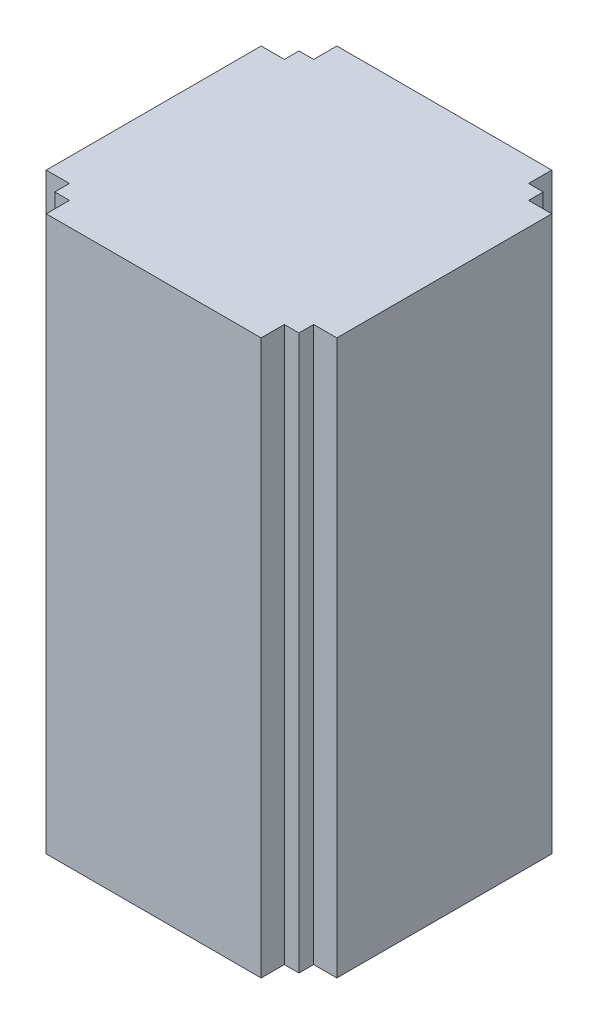
ISO-10303-21;
HEADER;
FILE_DESCRIPTION(('STEP AP214'),'2;1');
FILE_NAME('part.step','',(''),(''),'','','');
FILE_SCHEMA(('AUTOMOTIVE_DESIGN { 1 0 10303 214 1 1 1 1 }'));
ENDSEC;
DATA;
#1=APPLICATION_CONTEXT('core data for automotive mechanical design processes');
#2=APPLICATION_PROTOCOL_DEFINITION('international standard','automotive_design',2000,#1);
#3=PRODUCT_CONTEXT('',#1,'mechanical');
#4=PRODUCT('Part','Part','',(#3));
#5=PRODUCT_RELATED_PRODUCT_CATEGORY('part','',(#4));
#6=PRODUCT_DEFINITION_FORMATION('','',#4);
#7=PRODUCT_DEFINITION_CONTEXT('part definition',#1,'design');
#8=PRODUCT_DEFINITION('design','',#6,#7);
#9=PRODUCT_DEFINITION_SHAPE('','',#8);
#10=(LENGTH_UNIT() NAMED_UNIT(*) SI_UNIT(.MILLI.,.METRE.));
#11=(NAMED_UNIT(*) PLANE_ANGLE_UNIT() SI_UNIT($,.RADIAN.));
#12=(NAMED_UNIT(*) SI_UNIT($,.STERADIAN.) SOLID_ANGLE_UNIT());
#13=UNCERTAINTY_MEASURE_WITH_UNIT(LENGTH_MEASURE(1.E-05),#10,'distance_accuracy_value','');
#14=(GEOMETRIC_REPRESENTATION_CONTEXT(3) GLOBAL_UNCERTAINTY_ASSIGNED_CONTEXT((#13)) GLOBAL_UNIT_ASSIGNED_CONTEXT((#10,
#11,#12)) REPRESENTATION_CONTEXT('',''));
#15=CARTESIAN_POINT('',(0.,0.,0.));
#16=DIRECTION('',(0.,0.,1.));
#17=DIRECTION('',(1.,0.,0.));
#18=AXIS2_PLACEMENT_3D('',#15,#16,#17);
#19=CARTESIAN_POINT('',(50.,227.,-44.));
#20=DIRECTION('',(-1.,0.,0.));
#21=DIRECTION('',(0.,0.,1.));
#22=AXIS2_PLACEMENT_3D('',#19,#20,#21);
#23=PLANE('',#22);
#24=DIRECTION('',(0.,0.,-1.));
#25=VECTOR('',#24,1.);
#26=CARTESIAN_POINT('',(50.,0.,-44.));
#27=LINE('',#26,#25);
#28=CARTESIAN_POINT('',(50.,0.,-44.));
#29=VERTEX_POINT('',#28);
#30=CARTESIAN_POINT('',(50.,0.,-50.));
#31=VERTEX_POINT('',#30);
#32=EDGE_CURVE('E200',#29,#31,#27,.T.);
#33=ORIENTED_EDGE('',*,*,#32,.T.);
#34=DIRECTION('',(0.,-1.,0.));
#35=VECTOR('',#34,1.);
#36=CARTESIAN_POINT('',(50.,227.,-50.));
#37=LINE('',#36,#35);
#38=CARTESIAN_POINT('',(50.,227.,-50.));
#39=VERTEX_POINT('',#38);
#40=EDGE_CURVE('E11',#39,#31,#37,.T.);
#41=ORIENTED_EDGE('',*,*,#40,.F.);
#42=DIRECTION('',(0.,0.,-1.));
#43=VECTOR('',#42,1.);
#44=CARTESIAN_POINT('',(50.,227.,-44.));
#45=LINE('',#44,#43);
#46=CARTESIAN_POINT('',(50.,227.,-44.));
#47=VERTEX_POINT('',#46);
#48=EDGE_CURVE('E238',#47,#39,#45,.T.);
#49=ORIENTED_EDGE('',*,*,#48,.F.);
#50=DIRECTION('',(0.,-1.,0.));
#51=VECTOR('',#50,1.);
#52=CARTESIAN_POINT('',(50.,227.,-44.));
#53=LINE('',#52,#51);
#54=EDGE_CURVE('E196',#47,#29,#53,.T.);
#55=ORIENTED_EDGE('',*,*,#54,.T.);
#56=EDGE_LOOP('',(#33,#41,#49,#55));
#57=FACE_BOUND('',#56,.T.);
#58=ADVANCED_FACE('F32',(#57),#23,.F.);
#59=CARTESIAN_POINT('',(44.,227.,-50.));
#60=DIRECTION('',(0.,0.,1.));
#61=DIRECTION('',(1.,0.,0.));
#62=AXIS2_PLACEMENT_3D('',#59,#60,#61);
#63=PLANE('',#62);
#64=DIRECTION('',(-1.,0.,0.));
#65=VECTOR('',#64,1.);
#66=CARTESIAN_POINT('',(44.,0.,-50.));
#67=LINE('',#66,#65);
#68=CARTESIAN_POINT('',(44.,0.,-50.));
#69=VERTEX_POINT('',#68);
#70=EDGE_CURVE('E203',#31,#69,#67,.T.);
#71=ORIENTED_EDGE('',*,*,#70,.T.);
#72=DIRECTION('',(0.,-1.,0.));
#73=VECTOR('',#72,1.);
#74=CARTESIAN_POINT('',(44.,227.,-50.));
#75=LINE('',#74,#73);
#76=CARTESIAN_POINT('',(44.,227.,-50.));
#77=VERTEX_POINT('',#76);
#78=EDGE_CURVE('E40',#77,#69,#75,.T.);
#79=ORIENTED_EDGE('',*,*,#78,.F.);
#80=DIRECTION('',(-1.,0.,0.));
#81=VECTOR('',#80,1.);
#82=CARTESIAN_POINT('',(44.,227.,-50.));
#83=LINE('',#82,#81);
#84=EDGE_CURVE('E127',#39,#77,#83,.T.);
#85=ORIENTED_EDGE('',*,*,#84,.F.);
#86=ORIENTED_EDGE('',*,*,#40,.T.);
#87=EDGE_LOOP('',(#71,#79,#85,#86));
#88=FACE_BOUND('',#87,.T.);
#89=ADVANCED_FACE('F356',(#88),#63,.F.);
#90=CARTESIAN_POINT('',(44.,227.,-50.));
#91=DIRECTION('',(-1.,0.,0.));
#92=DIRECTION('',(0.,0.,1.));
#93=AXIS2_PLACEMENT_3D('',#90,#91,#92);
#94=PLANE('',#93);
#95=DIRECTION('',(0.,0.,-1.));
#96=VECTOR('',#95,1.);
#97=CARTESIAN_POINT('',(44.,0.,-50.));
#98=LINE('',#97,#96);
#99=CARTESIAN_POINT('',(44.,0.,-59.5));
#100=VERTEX_POINT('',#99);
#101=EDGE_CURVE('E205',#69,#100,#98,.T.);
#102=ORIENTED_EDGE('',*,*,#101,.T.);
#103=DIRECTION('',(0.,-1.,0.));
#104=VECTOR('',#103,1.);
#105=CARTESIAN_POINT('',(44.,227.,-59.5));
#106=LINE('',#105,#104);
#107=CARTESIAN_POINT('',(44.,227.,-59.5));
#108=VERTEX_POINT('',#107);
#109=EDGE_CURVE('E281',#108,#100,#106,.T.);
#110=ORIENTED_EDGE('',*,*,#109,.F.);
#111=DIRECTION('',(0.,0.,-1.));
#112=VECTOR('',#111,1.);
#113=CARTESIAN_POINT('',(44.,227.,-50.));
#114=LINE('',#113,#112);
#115=EDGE_CURVE('E289',#77,#108,#114,.T.);
#116=ORIENTED_EDGE('',*,*,#115,.F.);
#117=ORIENTED_EDGE('',*,*,#78,.T.);
#118=EDGE_LOOP('',(#102,#110,#116,#117));
#119=FACE_BOUND('',#118,.T.);
#120=ADVANCED_FACE('F287',(#119),#94,.F.);
#121=CARTESIAN_POINT('',(-44.,227.,-59.5));
#122=DIRECTION('',(0.,0.,1.));
#123=DIRECTION('',(1.,0.,0.));
#124=AXIS2_PLACEMENT_3D('',#121,#122,#123);
#125=PLANE('',#124);
#126=DIRECTION('',(-1.,0.,0.));
#127=VECTOR('',#126,1.);
#128=CARTESIAN_POINT('',(-44.,0.,-59.5));
#129=LINE('',#128,#127);
#130=CARTESIAN_POINT('',(-44.,0.,-59.5));
#131=VERTEX_POINT('',#130);
#132=EDGE_CURVE('E207',#100,#131,#129,.T.);
#133=ORIENTED_EDGE('',*,*,#132,.T.);
#134=DIRECTION('',(0.,-1.,0.));
#135=VECTOR('',#134,1.);
#136=CARTESIAN_POINT('',(-44.,227.,-59.5));
#137=LINE('',#136,#135);
#138=CARTESIAN_POINT('',(-44.,227.,-59.5));
#139=VERTEX_POINT('',#138);
#140=EDGE_CURVE('E278',#139,#131,#137,.T.);
#141=ORIENTED_EDGE('',*,*,#140,.F.);
#142=DIRECTION('',(-1.,0.,0.));
#143=VECTOR('',#142,1.);
#144=CARTESIAN_POINT('',(-44.,227.,-59.5));
#145=LINE('',#144,#143);
#146=EDGE_CURVE('E307',#108,#139,#145,.T.);
#147=ORIENTED_EDGE('',*,*,#146,.F.);
#148=ORIENTED_EDGE('',*,*,#109,.T.);
#149=EDGE_LOOP('',(#133,#141,#147,#148));
#150=FACE_BOUND('',#149,.T.);
#151=ADVANCED_FACE('F298',(#150),#125,.F.);
#152=CARTESIAN_POINT('',(-44.,227.,-50.));
#153=DIRECTION('',(1.,0.,0.));
#154=DIRECTION('',(0.,0.,-1.));
#155=AXIS2_PLACEMENT_3D('',#152,#153,#154);
#156=PLANE('',#155);
#157=DIRECTION('',(0.,0.,1.));
#158=VECTOR('',#157,1.);
#159=CARTESIAN_POINT('',(-44.,0.,-50.));
#160=LINE('',#159,#158);
#161=CARTESIAN_POINT('',(-44.,0.,-50.));
#162=VERTEX_POINT('',#161);
#163=EDGE_CURVE('E209',#131,#162,#160,.T.);
#164=ORIENTED_EDGE('',*,*,#163,.T.);
#165=DIRECTION('',(0.,-1.,0.));
#166=VECTOR('',#165,1.);
#167=CARTESIAN_POINT('',(-44.,227.,-50.));
#168=LINE('',#167,#166);
#169=CARTESIAN_POINT('',(-44.,227.,-50.));
#170=VERTEX_POINT('',#169);
#171=EDGE_CURVE('E275',#170,#162,#168,.T.);
#172=ORIENTED_EDGE('',*,*,#171,.F.);
#173=DIRECTION('',(0.,0.,1.));
#174=VECTOR('',#173,1.);
#175=CARTESIAN_POINT('',(-44.,227.,-50.));
#176=LINE('',#175,#174);
#177=EDGE_CURVE('E304',#139,#170,#176,.T.);
#178=ORIENTED_EDGE('',*,*,#177,.F.);
#179=ORIENTED_EDGE('',*,*,#140,.T.);
#180=EDGE_LOOP('',(#164,#172,#178,#179));
#181=FACE_BOUND('',#180,.T.);
#182=ADVANCED_FACE('F302',(#181),#156,.F.);
#183=CARTESIAN_POINT('',(-50.,227.,-50.));
#184=DIRECTION('',(0.,0.,1.));
#185=DIRECTION('',(1.,0.,0.));
#186=AXIS2_PLACEMENT_3D('',#183,#184,#185);
#187=PLANE('',#186);
#188=DIRECTION('',(-1.,0.,0.));
#189=VECTOR('',#188,1.);
#190=CARTESIAN_POINT('',(-50.,0.,-50.));
#191=LINE('',#190,#189);
#192=CARTESIAN_POINT('',(-50.,0.,-50.));
#193=VERTEX_POINT('',#192);
#194=EDGE_CURVE('E211',#162,#193,#191,.T.);
#195=ORIENTED_EDGE('',*,*,#194,.T.);
#196=DIRECTION('',(0.,-1.,0.));
#197=VECTOR('',#196,1.);
#198=CARTESIAN_POINT('',(-50.,227.,-50.));
#199=LINE('',#198,#197);
#200=CARTESIAN_POINT('',(-50.,227.,-50.));
#201=VERTEX_POINT('',#200);
#202=EDGE_CURVE('E272',#201,#193,#199,.T.);
#203=ORIENTED_EDGE('',*,*,#202,.F.);
#204=DIRECTION('',(-1.,0.,0.));
#205=VECTOR('',#204,1.);
#206=CARTESIAN_POINT('',(-50.,227.,-50.));
#207=LINE('',#206,#205);
#208=EDGE_CURVE('E306',#170,#201,#207,.T.);
#209=ORIENTED_EDGE('',*,*,#208,.F.);
#210=ORIENTED_EDGE('',*,*,#171,.T.);
#211=EDGE_LOOP('',(#195,#203,#209,#210));
#212=FACE_BOUND('',#211,.T.);
#213=ADVANCED_FACE('F369',(#212),#187,.F.);
#214=CARTESIAN_POINT('',(-50.,227.,-44.));
#215=DIRECTION('',(1.,0.,0.));
#216=DIRECTION('',(0.,0.,-1.));
#217=AXIS2_PLACEMENT_3D('',#214,#215,#216);
#218=PLANE('',#217);
#219=DIRECTION('',(0.,0.,1.));
#220=VECTOR('',#219,1.);
#221=CARTESIAN_POINT('',(-50.,0.,-44.));
#222=LINE('',#221,#220);
#223=CARTESIAN_POINT('',(-50.,0.,-44.));
#224=VERTEX_POINT('',#223);
#225=EDGE_CURVE('E213',#193,#224,#222,.T.);
#226=ORIENTED_EDGE('',*,*,#225,.T.);
#227=DIRECTION('',(0.,-1.,0.));
#228=VECTOR('',#227,1.);
#229=CARTESIAN_POINT('',(-50.,227.,-44.));
#230=LINE('',#229,#228);
#231=CARTESIAN_POINT('',(-50.,227.,-44.));
#232=VERTEX_POINT('',#231);
#233=EDGE_CURVE('E269',#232,#224,#230,.T.);
#234=ORIENTED_EDGE('',*,*,#233,.F.);
#235=DIRECTION('',(0.,0.,1.));
#236=VECTOR('',#235,1.);
#237=CARTESIAN_POINT('',(-50.,227.,-44.));
#238=LINE('',#237,#236);
#239=EDGE_CURVE('E309',#201,#232,#238,.T.);
#240=ORIENTED_EDGE('',*,*,#239,.F.);
#241=ORIENTED_EDGE('',*,*,#202,.T.);
#242=EDGE_LOOP('',(#226,#234,#240,#241));
#243=FACE_BOUND('',#242,.T.);
#244=ADVANCED_FACE('F372',(#243),#218,.F.);
#245=CARTESIAN_POINT('',(-59.5,227.,-44.));
#246=DIRECTION('',(0.,0.,1.));
#247=DIRECTION('',(1.,0.,0.));
#248=AXIS2_PLACEMENT_3D('',#245,#246,#247);
#249=PLANE('',#248);
#250=DIRECTION('',(-1.,0.,0.));
#251=VECTOR('',#250,1.);
#252=CARTESIAN_POINT('',(-59.5,0.,-44.));
#253=LINE('',#252,#251);
#254=CARTESIAN_POINT('',(-59.5,0.,-44.));
#255=VERTEX_POINT('',#254);
#256=EDGE_CURVE('E215',#224,#255,#253,.T.);
#257=ORIENTED_EDGE('',*,*,#256,.T.);
#258=DIRECTION('',(0.,-1.,0.));
#259=VECTOR('',#258,1.);
#260=CARTESIAN_POINT('',(-59.5,227.,-44.));
#261=LINE('',#260,#259);
#262=CARTESIAN_POINT('',(-59.5,227.,-44.));
#263=VERTEX_POINT('',#262);
#264=EDGE_CURVE('E266',#263,#255,#261,.T.);
#265=ORIENTED_EDGE('',*,*,#264,.F.);
#266=DIRECTION('',(-1.,0.,0.));
#267=VECTOR('',#266,1.);
#268=CARTESIAN_POINT('',(-59.5,227.,-44.));
#269=LINE('',#268,#267);
#270=EDGE_CURVE('E315',#232,#263,#269,.T.);
#271=ORIENTED_EDGE('',*,*,#270,.F.);
#272=ORIENTED_EDGE('',*,*,#233,.T.);
#273=EDGE_LOOP('',(#257,#265,#271,#272));
#274=FACE_BOUND('',#273,.T.);
#275=ADVANCED_FACE('F376',(#274),#249,.F.);
#276=CARTESIAN_POINT('',(-59.5,227.,44.));
#277=DIRECTION('',(1.,0.,0.));
#278=DIRECTION('',(0.,0.,-1.));
#279=AXIS2_PLACEMENT_3D('',#276,#277,#278);
#280=PLANE('',#279);
#281=DIRECTION('',(0.,0.,1.));
#282=VECTOR('',#281,1.);
#283=CARTESIAN_POINT('',(-59.5,0.,44.));
#284=LINE('',#283,#282);
#285=CARTESIAN_POINT('',(-59.5,0.,44.));
#286=VERTEX_POINT('',#285);
#287=EDGE_CURVE('E217',#255,#286,#284,.T.);
#288=ORIENTED_EDGE('',*,*,#287,.T.);
#289=DIRECTION('',(0.,-1.,0.));
#290=VECTOR('',#289,1.);
#291=CARTESIAN_POINT('',(-59.5,227.,44.));
#292=LINE('',#291,#290);
#293=CARTESIAN_POINT('',(-59.5,227.,44.));
#294=VERTEX_POINT('',#293);
#295=EDGE_CURVE('E263',#294,#286,#292,.T.);
#296=ORIENTED_EDGE('',*,*,#295,.F.);
#297=DIRECTION('',(0.,0.,1.));
#298=VECTOR('',#297,1.);
#299=CARTESIAN_POINT('',(-59.5,227.,44.));
#300=LINE('',#299,#298);
#301=EDGE_CURVE('E317',#263,#294,#300,.T.);
#302=ORIENTED_EDGE('',*,*,#301,.F.);
#303=ORIENTED_EDGE('',*,*,#264,.T.);
#304=EDGE_LOOP('',(#288,#296,#302,#303));
#305=FACE_BOUND('',#304,.T.);
#306=ADVANCED_FACE('F380',(#305),#280,.F.);
#307=CARTESIAN_POINT('',(-59.5,227.,44.));
#308=DIRECTION('',(0.,0.,-1.));
#309=DIRECTION('',(-1.,0.,0.));
#310=AXIS2_PLACEMENT_3D('',#307,#308,#309);
#311=PLANE('',#310);
#312=DIRECTION('',(1.,0.,0.));
#313=VECTOR('',#312,1.);
#314=CARTESIAN_POINT('',(-59.5,0.,44.));
#315=LINE('',#314,#313);
#316=CARTESIAN_POINT('',(-50.,0.,44.));
#317=VERTEX_POINT('',#316);
#318=EDGE_CURVE('E219',#286,#317,#315,.T.);
#319=ORIENTED_EDGE('',*,*,#318,.T.);
#320=DIRECTION('',(0.,-1.,0.));
#321=VECTOR('',#320,1.);
#322=CARTESIAN_POINT('',(-50.,227.,44.));
#323=LINE('',#322,#321);
#324=CARTESIAN_POINT('',(-50.,227.,44.));
#325=VERTEX_POINT('',#324);
#326=EDGE_CURVE('E260',#325,#317,#323,.T.);
#327=ORIENTED_EDGE('',*,*,#326,.F.);
#328=DIRECTION('',(1.,0.,0.));
#329=VECTOR('',#328,1.);
#330=CARTESIAN_POINT('',(-59.5,227.,44.));
#331=LINE('',#330,#329);
#332=EDGE_CURVE('E319',#294,#325,#331,.T.);
#333=ORIENTED_EDGE('',*,*,#332,.F.);
#334=ORIENTED_EDGE('',*,*,#295,.T.);
#335=EDGE_LOOP('',(#319,#327,#333,#334));
#336=FACE_BOUND('',#335,.T.);
#337=ADVANCED_FACE('F384',(#336),#311,.F.);
#338=CARTESIAN_POINT('',(-50.,227.,50.));
#339=DIRECTION('',(1.,0.,0.));
#340=DIRECTION('',(0.,0.,-1.));
#341=AXIS2_PLACEMENT_3D('',#338,#339,#340);
#342=PLANE('',#341);
#343=DIRECTION('',(0.,0.,1.));
#344=VECTOR('',#343,1.);
#345=CARTESIAN_POINT('',(-50.,0.,50.));
#346=LINE('',#345,#344);
#347=CARTESIAN_POINT('',(-50.,0.,50.));
#348=VERTEX_POINT('',#347);
#349=EDGE_CURVE('E221',#317,#348,#346,.T.);
#350=ORIENTED_EDGE('',*,*,#349,.T.);
#351=DIRECTION('',(0.,-1.,0.));
#352=VECTOR('',#351,1.);
#353=CARTESIAN_POINT('',(-50.,227.,50.));
#354=LINE('',#353,#352);
#355=CARTESIAN_POINT('',(-50.,227.,50.));
#356=VERTEX_POINT('',#355);
#357=EDGE_CURVE('E257',#356,#348,#354,.T.);
#358=ORIENTED_EDGE('',*,*,#357,.F.);
#359=DIRECTION('',(0.,0.,1.));
#360=VECTOR('',#359,1.);
#361=CARTESIAN_POINT('',(-50.,227.,50.));
#362=LINE('',#361,#360);
#363=EDGE_CURVE('E321',#325,#356,#362,.T.);
#364=ORIENTED_EDGE('',*,*,#363,.F.);
#365=ORIENTED_EDGE('',*,*,#326,.T.);
#366=EDGE_LOOP('',(#350,#358,#364,#365));
#367=FACE_BOUND('',#366,.T.);
#368=ADVANCED_FACE('F388',(#367),#342,.F.);
#369=CARTESIAN_POINT('',(-50.,227.,50.));
#370=DIRECTION('',(0.,0.,-1.));
#371=DIRECTION('',(-1.,0.,0.));
#372=AXIS2_PLACEMENT_3D('',#369,#370,#371);
#373=PLANE('',#372);
#374=DIRECTION('',(1.,0.,0.));
#375=VECTOR('',#374,1.);
#376=CARTESIAN_POINT('',(-50.,0.,50.));
#377=LINE('',#376,#375);
#378=CARTESIAN_POINT('',(-44.,0.,50.));
#379=VERTEX_POINT('',#378);
#380=EDGE_CURVE('E223',#348,#379,#377,.T.);
#381=ORIENTED_EDGE('',*,*,#380,.T.);
#382=DIRECTION('',(0.,-1.,0.));
#383=VECTOR('',#382,1.);
#384=CARTESIAN_POINT('',(-44.,227.,50.));
#385=LINE('',#384,#383);
#386=CARTESIAN_POINT('',(-44.,227.,50.));
#387=VERTEX_POINT('',#386);
#388=EDGE_CURVE('E254',#387,#379,#385,.T.);
#389=ORIENTED_EDGE('',*,*,#388,.F.);
#390=DIRECTION('',(1.,0.,0.));
#391=VECTOR('',#390,1.);
#392=CARTESIAN_POINT('',(-50.,227.,50.));
#393=LINE('',#392,#391);
#394=EDGE_CURVE('E323',#356,#387,#393,.T.);
#395=ORIENTED_EDGE('',*,*,#394,.F.);
#396=ORIENTED_EDGE('',*,*,#357,.T.);
#397=EDGE_LOOP('',(#381,#389,#395,#396));
#398=FACE_BOUND('',#397,.T.);
#399=ADVANCED_FACE('F392',(#398),#373,.F.);
#400=CARTESIAN_POINT('',(-44.,227.,59.5));
#401=DIRECTION('',(1.,0.,0.));
#402=DIRECTION('',(0.,0.,-1.));
#403=AXIS2_PLACEMENT_3D('',#400,#401,#402);
#404=PLANE('',#403);
#405=DIRECTION('',(0.,0.,1.));
#406=VECTOR('',#405,1.);
#407=CARTESIAN_POINT('',(-44.,0.,59.5));
#408=LINE('',#407,#406);
#409=CARTESIAN_POINT('',(-44.,0.,59.5));
#410=VERTEX_POINT('',#409);
#411=EDGE_CURVE('E225',#379,#410,#408,.T.);
#412=ORIENTED_EDGE('',*,*,#411,.T.);
#413=DIRECTION('',(0.,-1.,0.));
#414=VECTOR('',#413,1.);
#415=CARTESIAN_POINT('',(-44.,227.,59.5));
#416=LINE('',#415,#414);
#417=CARTESIAN_POINT('',(-44.,227.,59.5));
#418=VERTEX_POINT('',#417);
#419=EDGE_CURVE('E251',#418,#410,#416,.T.);
#420=ORIENTED_EDGE('',*,*,#419,.F.);
#421=DIRECTION('',(0.,0.,1.));
#422=VECTOR('',#421,1.);
#423=CARTESIAN_POINT('',(-44.,227.,59.5));
#424=LINE('',#423,#422);
#425=EDGE_CURVE('E325',#387,#418,#424,.T.);
#426=ORIENTED_EDGE('',*,*,#425,.F.);
#427=ORIENTED_EDGE('',*,*,#388,.T.);
#428=EDGE_LOOP('',(#412,#420,#426,#427));
#429=FACE_BOUND('',#428,.T.);
#430=ADVANCED_FACE('F396',(#429),#404,.F.);
#431=CARTESIAN_POINT('',(-44.,227.,59.5));
#432=DIRECTION('',(0.,0.,-1.));
#433=DIRECTION('',(-1.,0.,0.));
#434=AXIS2_PLACEMENT_3D('',#431,#432,#433);
#435=PLANE('',#434);
#436=DIRECTION('',(1.,0.,0.));
#437=VECTOR('',#436,1.);
#438=CARTESIAN_POINT('',(-44.,0.,59.5));
#439=LINE('',#438,#437);
#440=CARTESIAN_POINT('',(44.,0.,59.5));
#441=VERTEX_POINT('',#440);
#442=EDGE_CURVE('E227',#410,#441,#439,.T.);
#443=ORIENTED_EDGE('',*,*,#442,.T.);
#444=DIRECTION('',(0.,-1.,0.));
#445=VECTOR('',#444,1.);
#446=CARTESIAN_POINT('',(44.,227.,59.5));
#447=LINE('',#446,#445);
#448=CARTESIAN_POINT('',(44.,227.,59.5));
#449=VERTEX_POINT('',#448);
#450=EDGE_CURVE('E248',#449,#441,#447,.T.);
#451=ORIENTED_EDGE('',*,*,#450,.F.);
#452=DIRECTION('',(1.,0.,0.));
#453=VECTOR('',#452,1.);
#454=CARTESIAN_POINT('',(-44.,227.,59.5));
#455=LINE('',#454,#453);
#456=EDGE_CURVE('E327',#418,#449,#455,.T.);
#457=ORIENTED_EDGE('',*,*,#456,.F.);
#458=ORIENTED_EDGE('',*,*,#419,.T.);
#459=EDGE_LOOP('',(#443,#451,#457,#458));
#460=FACE_BOUND('',#459,.T.);
#461=ADVANCED_FACE('F400',(#460),#435,.F.);
#462=CARTESIAN_POINT('',(44.,227.,59.5));
#463=DIRECTION('',(-1.,0.,0.));
#464=DIRECTION('',(0.,0.,1.));
#465=AXIS2_PLACEMENT_3D('',#462,#463,#464);
#466=PLANE('',#465);
#467=DIRECTION('',(0.,0.,-1.));
#468=VECTOR('',#467,1.);
#469=CARTESIAN_POINT('',(44.,0.,59.5));
#470=LINE('',#469,#468);
#471=CARTESIAN_POINT('',(44.,0.,50.));
#472=VERTEX_POINT('',#471);
#473=EDGE_CURVE('E229',#441,#472,#470,.T.);
#474=ORIENTED_EDGE('',*,*,#473,.T.);
#475=DIRECTION('',(0.,-1.,0.));
#476=VECTOR('',#475,1.);
#477=CARTESIAN_POINT('',(44.,227.,50.));
#478=LINE('',#477,#476);
#479=CARTESIAN_POINT('',(44.,227.,50.));
#480=VERTEX_POINT('',#479);
#481=EDGE_CURVE('E245',#480,#472,#478,.T.);
#482=ORIENTED_EDGE('',*,*,#481,.F.);
#483=DIRECTION('',(0.,0.,-1.));
#484=VECTOR('',#483,1.);
#485=CARTESIAN_POINT('',(44.,227.,59.5));
#486=LINE('',#485,#484);
#487=EDGE_CURVE('E329',#449,#480,#486,.T.);
#488=ORIENTED_EDGE('',*,*,#487,.F.);
#489=ORIENTED_EDGE('',*,*,#450,.T.);
#490=EDGE_LOOP('',(#474,#482,#488,#489));
#491=FACE_BOUND('',#490,.T.);
#492=ADVANCED_FACE('F404',(#491),#466,.F.);
#493=CARTESIAN_POINT('',(44.,227.,50.));
#494=DIRECTION('',(0.,0.,-1.));
#495=DIRECTION('',(-1.,0.,0.));
#496=AXIS2_PLACEMENT_3D('',#493,#494,#495);
#497=PLANE('',#496);
#498=DIRECTION('',(1.,0.,0.));
#499=VECTOR('',#498,1.);
#500=CARTESIAN_POINT('',(44.,0.,50.));
#501=LINE('',#500,#499);
#502=CARTESIAN_POINT('',(50.,0.,50.));
#503=VERTEX_POINT('',#502);
#504=EDGE_CURVE('E231',#472,#503,#501,.T.);
#505=ORIENTED_EDGE('',*,*,#504,.T.);
#506=DIRECTION('',(0.,-1.,0.));
#507=VECTOR('',#506,1.);
#508=CARTESIAN_POINT('',(50.,227.,50.));
#509=LINE('',#508,#507);
#510=CARTESIAN_POINT('',(50.,227.,50.));
#511=VERTEX_POINT('',#510);
#512=EDGE_CURVE('E242',#511,#503,#509,.T.);
#513=ORIENTED_EDGE('',*,*,#512,.F.);
#514=DIRECTION('',(1.,0.,0.));
#515=VECTOR('',#514,1.);
#516=CARTESIAN_POINT('',(44.,227.,50.));
#517=LINE('',#516,#515);
#518=EDGE_CURVE('E331',#480,#511,#517,.T.);
#519=ORIENTED_EDGE('',*,*,#518,.F.);
#520=ORIENTED_EDGE('',*,*,#481,.T.);
#521=EDGE_LOOP('',(#505,#513,#519,#520));
#522=FACE_BOUND('',#521,.T.);
#523=ADVANCED_FACE('F337',(#522),#497,.F.);
#524=CARTESIAN_POINT('',(50.,227.,50.));
#525=DIRECTION('',(-1.,0.,0.));
#526=DIRECTION('',(0.,0.,1.));
#527=AXIS2_PLACEMENT_3D('',#524,#525,#526);
#528=PLANE('',#527);
#529=DIRECTION('',(0.,0.,-1.));
#530=VECTOR('',#529,1.);
#531=CARTESIAN_POINT('',(50.,0.,50.));
#532=LINE('',#531,#530);
#533=CARTESIAN_POINT('',(50.,0.,44.));
#534=VERTEX_POINT('',#533);
#535=EDGE_CURVE('E233',#503,#534,#532,.T.);
#536=ORIENTED_EDGE('',*,*,#535,.T.);
#537=DIRECTION('',(0.,-1.,0.));
#538=VECTOR('',#537,1.);
#539=CARTESIAN_POINT('',(50.,227.,44.));
#540=LINE('',#539,#538);
#541=CARTESIAN_POINT('',(50.,227.,44.));
#542=VERTEX_POINT('',#541);
#543=EDGE_CURVE('E191',#542,#534,#540,.T.);
#544=ORIENTED_EDGE('',*,*,#543,.F.);
#545=DIRECTION('',(0.,0.,-1.));
#546=VECTOR('',#545,1.);
#547=CARTESIAN_POINT('',(50.,227.,50.));
#548=LINE('',#547,#546);
#549=EDGE_CURVE('E182',#511,#542,#548,.T.);
#550=ORIENTED_EDGE('',*,*,#549,.F.);
#551=ORIENTED_EDGE('',*,*,#512,.T.);
#552=EDGE_LOOP('',(#536,#544,#550,#551));
#553=FACE_BOUND('',#552,.T.);
#554=ADVANCED_FACE('F341',(#553),#528,.F.);
#555=CARTESIAN_POINT('',(50.,227.,44.));
#556=DIRECTION('',(0.,0.,-1.));
#557=DIRECTION('',(-1.,0.,0.));
#558=AXIS2_PLACEMENT_3D('',#555,#556,#557);
#559=PLANE('',#558);
#560=DIRECTION('',(1.,0.,0.));
#561=VECTOR('',#560,1.);
#562=CARTESIAN_POINT('',(50.,0.,44.));
#563=LINE('',#562,#561);
#564=CARTESIAN_POINT('',(59.5,0.,44.));
#565=VERTEX_POINT('',#564);
#566=EDGE_CURVE('E190',#534,#565,#563,.T.);
#567=ORIENTED_EDGE('',*,*,#566,.T.);
#568=DIRECTION('',(0.,-1.,0.));
#569=VECTOR('',#568,1.);
#570=CARTESIAN_POINT('',(59.5,227.,44.));
#571=LINE('',#570,#569);
#572=CARTESIAN_POINT('',(59.5,227.,44.));
#573=VERTEX_POINT('',#572);
#574=EDGE_CURVE('E187',#573,#565,#571,.T.);
#575=ORIENTED_EDGE('',*,*,#574,.F.);
#576=DIRECTION('',(1.,0.,0.));
#577=VECTOR('',#576,1.);
#578=CARTESIAN_POINT('',(50.,227.,44.));
#579=LINE('',#578,#577);
#580=EDGE_CURVE('E176',#542,#573,#579,.T.);
#581=ORIENTED_EDGE('',*,*,#580,.F.);
#582=ORIENTED_EDGE('',*,*,#543,.T.);
#583=EDGE_LOOP('',(#567,#575,#581,#582));
#584=FACE_BOUND('',#583,.T.);
#585=ADVANCED_FACE('F188',(#584),#559,.F.);
#586=CARTESIAN_POINT('',(59.5,227.,44.));
#587=DIRECTION('',(-1.,0.,0.));
#588=DIRECTION('',(0.,0.,1.));
#589=AXIS2_PLACEMENT_3D('',#586,#587,#588);
#590=PLANE('',#589);
#591=DIRECTION('',(0.,0.,-1.));
#592=VECTOR('',#591,1.);
#593=CARTESIAN_POINT('',(59.5,0.,44.));
#594=LINE('',#593,#592);
#595=CARTESIAN_POINT('',(59.5,0.,-44.));
#596=VERTEX_POINT('',#595);
#597=EDGE_CURVE('E113',#565,#596,#594,.T.);
#598=ORIENTED_EDGE('',*,*,#597,.T.);
#599=DIRECTION('',(0.,-1.,0.));
#600=VECTOR('',#599,1.);
#601=CARTESIAN_POINT('',(59.5,227.,-44.));
#602=LINE('',#601,#600);
#603=CARTESIAN_POINT('',(59.5,227.,-44.));
#604=VERTEX_POINT('',#603);
#605=EDGE_CURVE('E192',#604,#596,#602,.T.);
#606=ORIENTED_EDGE('',*,*,#605,.F.);
#607=DIRECTION('',(0.,0.,-1.));
#608=VECTOR('',#607,1.);
#609=CARTESIAN_POINT('',(59.5,227.,44.));
#610=LINE('',#609,#608);
#611=EDGE_CURVE('E180',#573,#604,#610,.T.);
#612=ORIENTED_EDGE('',*,*,#611,.F.);
#613=ORIENTED_EDGE('',*,*,#574,.T.);
#614=EDGE_LOOP('',(#598,#606,#612,#613));
#615=FACE_BOUND('',#614,.T.);
#616=ADVANCED_FACE('F194',(#615),#590,.F.);
#617=CARTESIAN_POINT('',(50.,227.,-44.));
#618=DIRECTION('',(0.,0.,1.));
#619=DIRECTION('',(1.,0.,0.));
#620=AXIS2_PLACEMENT_3D('',#617,#618,#619);
#621=PLANE('',#620);
#622=DIRECTION('',(-1.,0.,0.));
#623=VECTOR('',#622,1.);
#624=CARTESIAN_POINT('',(50.,0.,-44.));
#625=LINE('',#624,#623);
#626=EDGE_CURVE('E119',#596,#29,#625,.T.);
#627=ORIENTED_EDGE('',*,*,#626,.T.);
#628=ORIENTED_EDGE('',*,*,#54,.F.);
#629=DIRECTION('',(-1.,0.,0.));
#630=VECTOR('',#629,1.);
#631=CARTESIAN_POINT('',(50.,227.,-44.));
#632=LINE('',#631,#630);
#633=EDGE_CURVE('E48',#604,#47,#632,.T.);
#634=ORIENTED_EDGE('',*,*,#633,.F.);
#635=ORIENTED_EDGE('',*,*,#605,.T.);
#636=EDGE_LOOP('',(#627,#628,#634,#635));
#637=FACE_BOUND('',#636,.T.);
#638=ADVANCED_FACE('F345',(#637),#621,.F.);
#639=CARTESIAN_POINT('',(0.,227.,0.));
#640=DIRECTION('',(0.,-1.,0.));
#641=DIRECTION('',(0.,0.,-1.));
#642=AXIS2_PLACEMENT_3D('',#639,#640,#641);
#643=PLANE('',#642);
#644=ORIENTED_EDGE('',*,*,#48,.T.);
#645=ORIENTED_EDGE('',*,*,#84,.T.);
#646=ORIENTED_EDGE('',*,*,#115,.T.);
#647=ORIENTED_EDGE('',*,*,#146,.T.);
#648=ORIENTED_EDGE('',*,*,#177,.T.);
#649=ORIENTED_EDGE('',*,*,#208,.T.);
#650=ORIENTED_EDGE('',*,*,#239,.T.);
#651=ORIENTED_EDGE('',*,*,#270,.T.);
#652=ORIENTED_EDGE('',*,*,#301,.T.);
#653=ORIENTED_EDGE('',*,*,#332,.T.);
#654=ORIENTED_EDGE('',*,*,#363,.T.);
#655=ORIENTED_EDGE('',*,*,#394,.T.);
#656=ORIENTED_EDGE('',*,*,#425,.T.);
#657=ORIENTED_EDGE('',*,*,#456,.T.);
#658=ORIENTED_EDGE('',*,*,#487,.T.);
#659=ORIENTED_EDGE('',*,*,#518,.T.);
#660=ORIENTED_EDGE('',*,*,#549,.T.);
#661=ORIENTED_EDGE('',*,*,#580,.T.);
#662=ORIENTED_EDGE('',*,*,#611,.T.);
#663=ORIENTED_EDGE('',*,*,#633,.T.);
#664=EDGE_LOOP('',(#644,#645,#646,#647,#648,#649,#650,#651,#652,#653,#654,#655,#656,#657,#658,
#659,#660,#661,#662,#663));
#665=FACE_BOUND('',#664,.T.);
#666=ADVANCED_FACE('F178',(#665),#643,.F.);
#667=CARTESIAN_POINT('',(0.,0.,0.));
#668=DIRECTION('',(0.,-1.,0.));
#669=DIRECTION('',(0.,0.,-1.));
#670=AXIS2_PLACEMENT_3D('',#667,#668,#669);
#671=PLANE('',#670);
#672=ORIENTED_EDGE('',*,*,#32,.F.);
#673=ORIENTED_EDGE('',*,*,#626,.F.);
#674=ORIENTED_EDGE('',*,*,#597,.F.);
#675=ORIENTED_EDGE('',*,*,#566,.F.);
#676=ORIENTED_EDGE('',*,*,#535,.F.);
#677=ORIENTED_EDGE('',*,*,#504,.F.);
#678=ORIENTED_EDGE('',*,*,#473,.F.);
#679=ORIENTED_EDGE('',*,*,#442,.F.);
#680=ORIENTED_EDGE('',*,*,#411,.F.);
#681=ORIENTED_EDGE('',*,*,#380,.F.);
#682=ORIENTED_EDGE('',*,*,#349,.F.);
#683=ORIENTED_EDGE('',*,*,#318,.F.);
#684=ORIENTED_EDGE('',*,*,#287,.F.);
#685=ORIENTED_EDGE('',*,*,#256,.F.);
#686=ORIENTED_EDGE('',*,*,#225,.F.);
#687=ORIENTED_EDGE('',*,*,#194,.F.);
#688=ORIENTED_EDGE('',*,*,#163,.F.);
#689=ORIENTED_EDGE('',*,*,#132,.F.);
#690=ORIENTED_EDGE('',*,*,#101,.F.);
#691=ORIENTED_EDGE('',*,*,#70,.F.);
#692=EDGE_LOOP('',(#672,#673,#674,#675,#676,#677,#678,#679,#680,#681,#682,#683,#684,#685,#686,
#687,#688,#689,#690,#691));
#693=FACE_BOUND('',#692,.T.);
#694=ADVANCED_FACE('F293',(#693),#671,.T.);
#695=CLOSED_SHELL('',(#58,#89,#120,#151,#182,#213,#244,#275,#306,#337,#368,#399,#430,#461,#492,
#523,#554,#585,#616,#638,#666,#694));
#696=MANIFOLD_SOLID_BREP('B2',#695);
#697=ADVANCED_BREP_SHAPE_REPRESENTATION('',(#18,#696),#14);
#698=SHAPE_DEFINITION_REPRESENTATION(#9,#697);
ENDSEC;
END-ISO-10303-21;
